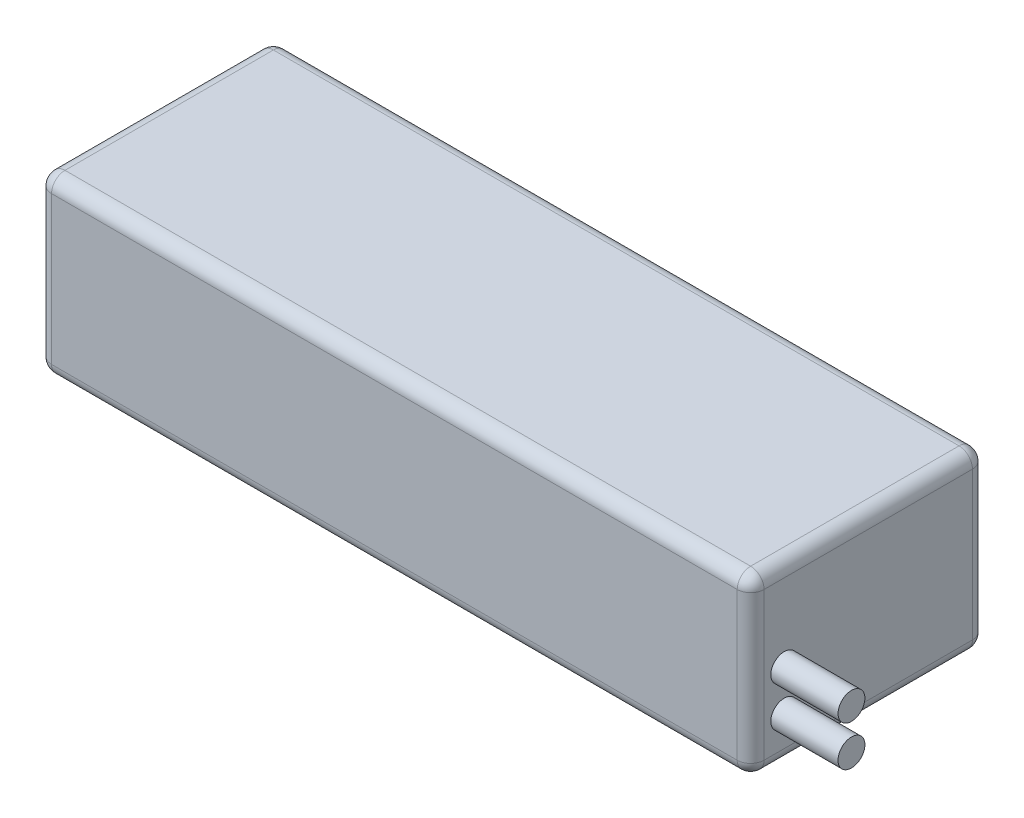
ISO-10303-21;
HEADER;
FILE_DESCRIPTION(('STEP AP214'),'2;1');
FILE_NAME('part.step','',(''),(''),'','','');
FILE_SCHEMA(('AUTOMOTIVE_DESIGN { 1 0 10303 214 1 1 1 1 }'));
ENDSEC;
DATA;
#1=APPLICATION_CONTEXT('core data for automotive mechanical design processes');
#2=APPLICATION_PROTOCOL_DEFINITION('international standard','automotive_design',2000,#1);
#3=PRODUCT_CONTEXT('',#1,'mechanical');
#4=PRODUCT('Part','Part','',(#3));
#5=PRODUCT_RELATED_PRODUCT_CATEGORY('part','',(#4));
#6=PRODUCT_DEFINITION_FORMATION('','',#4);
#7=PRODUCT_DEFINITION_CONTEXT('part definition',#1,'design');
#8=PRODUCT_DEFINITION('design','',#6,#7);
#9=PRODUCT_DEFINITION_SHAPE('','',#8);
#10=(LENGTH_UNIT() NAMED_UNIT(*) SI_UNIT(.MILLI.,.METRE.));
#11=(NAMED_UNIT(*) PLANE_ANGLE_UNIT() SI_UNIT($,.RADIAN.));
#12=(NAMED_UNIT(*) SI_UNIT($,.STERADIAN.) SOLID_ANGLE_UNIT());
#13=UNCERTAINTY_MEASURE_WITH_UNIT(LENGTH_MEASURE(1.E-05),#10,'distance_accuracy_value','');
#14=(GEOMETRIC_REPRESENTATION_CONTEXT(3) GLOBAL_UNCERTAINTY_ASSIGNED_CONTEXT((#13)) GLOBAL_UNIT_ASSIGNED_CONTEXT((#10,
#11,#12)) REPRESENTATION_CONTEXT('',''));
#15=CARTESIAN_POINT('',(0.,0.,0.));
#16=DIRECTION('',(0.,0.,1.));
#17=DIRECTION('',(1.,0.,0.));
#18=AXIS2_PLACEMENT_3D('',#15,#16,#17);
#19=CARTESIAN_POINT('',(53.,26.,-17.5));
#20=DIRECTION('',(-1.,0.,0.));
#21=DIRECTION('',(0.,0.,1.));
#22=AXIS2_PLACEMENT_3D('',#19,#20,#21);
#23=PLANE('',#22);
#24=CARTESIAN_POINT('',(53.,12.5,12.5));
#25=DIRECTION('',(-1.,0.,0.));
#26=DIRECTION('',(0.,0.,1.));
#27=AXIS2_PLACEMENT_3D('',#24,#25,#26);
#28=CIRCLE('',#27,2.);
#29=CARTESIAN_POINT('',(53.,12.5,14.5));
#30=VERTEX_POINT('',#29);
#31=EDGE_CURVE('E11',#30,#30,#28,.F.);
#32=ORIENTED_EDGE('',*,*,#31,.F.);
#33=EDGE_LOOP('',(#32));
#34=FACE_BOUND('',#33,.T.);
#35=CARTESIAN_POINT('',(53.,6.5,12.5));
#36=DIRECTION('',(-1.,0.,0.));
#37=DIRECTION('',(0.,0.,1.));
#38=AXIS2_PLACEMENT_3D('',#35,#36,#37);
#39=CIRCLE('',#38,2.);
#40=CARTESIAN_POINT('',(53.,6.5,14.5));
#41=VERTEX_POINT('',#40);
#42=EDGE_CURVE('E57',#41,#41,#39,.F.);
#43=ORIENTED_EDGE('',*,*,#42,.F.);
#44=EDGE_LOOP('',(#43));
#45=FACE_BOUND('',#44,.T.);
#46=DIRECTION('',(0.,-1.,0.));
#47=VECTOR('',#46,1.);
#48=CARTESIAN_POINT('',(53.,26.,15.5));
#49=LINE('',#48,#47);
#50=CARTESIAN_POINT('',(53.,24.,15.5));
#51=VERTEX_POINT('',#50);
#52=CARTESIAN_POINT('',(53.,2.,15.5));
#53=VERTEX_POINT('',#52);
#54=EDGE_CURVE('E214',#51,#53,#49,.T.);
#55=ORIENTED_EDGE('',*,*,#54,.T.);
#56=DIRECTION('',(0.,0.,-1.));
#57=VECTOR('',#56,1.);
#58=CARTESIAN_POINT('',(53.,2.,-17.5));
#59=LINE('',#58,#57);
#60=CARTESIAN_POINT('',(53.,2.,-15.5));
#61=VERTEX_POINT('',#60);
#62=EDGE_CURVE('E218',#53,#61,#59,.T.);
#63=ORIENTED_EDGE('',*,*,#62,.T.);
#64=DIRECTION('',(0.,-1.,0.));
#65=VECTOR('',#64,1.);
#66=CARTESIAN_POINT('',(53.,26.,-15.5));
#67=LINE('',#66,#65);
#68=CARTESIAN_POINT('',(53.,24.,-15.5));
#69=VERTEX_POINT('',#68);
#70=EDGE_CURVE('E211',#61,#69,#67,.F.);
#71=ORIENTED_EDGE('',*,*,#70,.T.);
#72=DIRECTION('',(0.,0.,-1.));
#73=VECTOR('',#72,1.);
#74=CARTESIAN_POINT('',(53.,24.,17.5));
#75=LINE('',#74,#73);
#76=EDGE_CURVE('E208',#69,#51,#75,.F.);
#77=ORIENTED_EDGE('',*,*,#76,.T.);
#78=EDGE_LOOP('',(#55,#63,#71,#77));
#79=FACE_BOUND('',#78,.T.);
#80=ADVANCED_FACE('F48',(#34,#45,#79),#23,.F.);
#81=CARTESIAN_POINT('',(-53.,26.,-17.5));
#82=DIRECTION('',(0.,0.,1.));
#83=DIRECTION('',(1.,0.,0.));
#84=AXIS2_PLACEMENT_3D('',#81,#82,#83);
#85=PLANE('',#84);
#86=DIRECTION('',(0.,-1.,0.));
#87=VECTOR('',#86,1.);
#88=CARTESIAN_POINT('',(51.,26.,-17.5));
#89=LINE('',#88,#87);
#90=CARTESIAN_POINT('',(51.,24.,-17.5));
#91=VERTEX_POINT('',#90);
#92=CARTESIAN_POINT('',(51.,2.,-17.5));
#93=VERTEX_POINT('',#92);
#94=EDGE_CURVE('E69',#91,#93,#89,.T.);
#95=ORIENTED_EDGE('',*,*,#94,.T.);
#96=DIRECTION('',(-1.,0.,0.));
#97=VECTOR('',#96,1.);
#98=CARTESIAN_POINT('',(-53.,2.,-17.5));
#99=LINE('',#98,#97);
#100=CARTESIAN_POINT('',(-51.,2.,-17.5));
#101=VERTEX_POINT('',#100);
#102=EDGE_CURVE('E64',#93,#101,#99,.T.);
#103=ORIENTED_EDGE('',*,*,#102,.T.);
#104=DIRECTION('',(0.,-1.,0.));
#105=VECTOR('',#104,1.);
#106=CARTESIAN_POINT('',(-51.,26.,-17.5));
#107=LINE('',#106,#105);
#108=CARTESIAN_POINT('',(-51.,24.,-17.5));
#109=VERTEX_POINT('',#108);
#110=EDGE_CURVE('E239',#101,#109,#107,.F.);
#111=ORIENTED_EDGE('',*,*,#110,.T.);
#112=DIRECTION('',(-1.,0.,0.));
#113=VECTOR('',#112,1.);
#114=CARTESIAN_POINT('',(53.,24.,-17.5));
#115=LINE('',#114,#113);
#116=EDGE_CURVE('E234',#109,#91,#115,.F.);
#117=ORIENTED_EDGE('',*,*,#116,.T.);
#118=EDGE_LOOP('',(#95,#103,#111,#117));
#119=FACE_BOUND('',#118,.T.);
#120=ADVANCED_FACE('F328',(#119),#85,.F.);
#121=CARTESIAN_POINT('',(-53.,26.,-17.5));
#122=DIRECTION('',(1.,0.,0.));
#123=DIRECTION('',(0.,0.,-1.));
#124=AXIS2_PLACEMENT_3D('',#121,#122,#123);
#125=PLANE('',#124);
#126=DIRECTION('',(0.,0.,1.));
#127=VECTOR('',#126,1.);
#128=CARTESIAN_POINT('',(-53.,2.,-17.5));
#129=LINE('',#128,#127);
#130=CARTESIAN_POINT('',(-53.,2.,-15.5));
#131=VERTEX_POINT('',#130);
#132=CARTESIAN_POINT('',(-53.,2.,15.5));
#133=VERTEX_POINT('',#132);
#134=EDGE_CURVE('E190',#131,#133,#129,.T.);
#135=ORIENTED_EDGE('',*,*,#134,.T.);
#136=DIRECTION('',(0.,-1.,0.));
#137=VECTOR('',#136,1.);
#138=CARTESIAN_POINT('',(-53.,26.,15.5));
#139=LINE('',#138,#137);
#140=CARTESIAN_POINT('',(-53.,24.,15.5));
#141=VERTEX_POINT('',#140);
#142=EDGE_CURVE('E145',#133,#141,#139,.F.);
#143=ORIENTED_EDGE('',*,*,#142,.T.);
#144=DIRECTION('',(0.,0.,1.));
#145=VECTOR('',#144,1.);
#146=CARTESIAN_POINT('',(-53.,24.,-17.5));
#147=LINE('',#146,#145);
#148=CARTESIAN_POINT('',(-53.,24.,-15.5));
#149=VERTEX_POINT('',#148);
#150=EDGE_CURVE('E183',#141,#149,#147,.F.);
#151=ORIENTED_EDGE('',*,*,#150,.T.);
#152=DIRECTION('',(0.,-1.,0.));
#153=VECTOR('',#152,1.);
#154=CARTESIAN_POINT('',(-53.,26.,-15.5));
#155=LINE('',#154,#153);
#156=EDGE_CURVE('E179',#149,#131,#155,.T.);
#157=ORIENTED_EDGE('',*,*,#156,.T.);
#158=EDGE_LOOP('',(#135,#143,#151,#157));
#159=FACE_BOUND('',#158,.T.);
#160=ADVANCED_FACE('F360',(#159),#125,.F.);
#161=CARTESIAN_POINT('',(-53.,26.,17.5));
#162=DIRECTION('',(0.,0.,-1.));
#163=DIRECTION('',(-1.,0.,0.));
#164=AXIS2_PLACEMENT_3D('',#161,#162,#163);
#165=PLANE('',#164);
#166=DIRECTION('',(1.,0.,0.));
#167=VECTOR('',#166,1.);
#168=CARTESIAN_POINT('',(-53.,24.,17.5));
#169=LINE('',#168,#167);
#170=CARTESIAN_POINT('',(51.,24.,17.5));
#171=VERTEX_POINT('',#170);
#172=CARTESIAN_POINT('',(-51.,24.,17.5));
#173=VERTEX_POINT('',#172);
#174=EDGE_CURVE('E176',#171,#173,#169,.F.);
#175=ORIENTED_EDGE('',*,*,#174,.T.);
#176=DIRECTION('',(0.,-1.,0.));
#177=VECTOR('',#176,1.);
#178=CARTESIAN_POINT('',(-51.,26.,17.5));
#179=LINE('',#178,#177);
#180=CARTESIAN_POINT('',(-51.,2.,17.5));
#181=VERTEX_POINT('',#180);
#182=EDGE_CURVE('E143',#173,#181,#179,.T.);
#183=ORIENTED_EDGE('',*,*,#182,.T.);
#184=DIRECTION('',(1.,0.,0.));
#185=VECTOR('',#184,1.);
#186=CARTESIAN_POINT('',(-53.,2.,17.5));
#187=LINE('',#186,#185);
#188=CARTESIAN_POINT('',(51.,2.,17.5));
#189=VERTEX_POINT('',#188);
#190=EDGE_CURVE('E164',#181,#189,#187,.T.);
#191=ORIENTED_EDGE('',*,*,#190,.T.);
#192=DIRECTION('',(0.,-1.,0.));
#193=VECTOR('',#192,1.);
#194=CARTESIAN_POINT('',(51.,26.,17.5));
#195=LINE('',#194,#193);
#196=EDGE_CURVE('E171',#189,#171,#195,.F.);
#197=ORIENTED_EDGE('',*,*,#196,.T.);
#198=EDGE_LOOP('',(#175,#183,#191,#197));
#199=FACE_BOUND('',#198,.T.);
#200=ADVANCED_FACE('F174',(#199),#165,.F.);
#201=CARTESIAN_POINT('',(0.,26.,0.));
#202=DIRECTION('',(0.,1.,0.));
#203=DIRECTION('',(0.,0.,1.));
#204=AXIS2_PLACEMENT_3D('',#201,#202,#203);
#205=PLANE('',#204);
#206=DIRECTION('',(0.,0.,1.));
#207=VECTOR('',#206,1.);
#208=CARTESIAN_POINT('',(-51.,26.,17.5));
#209=LINE('',#208,#207);
#210=CARTESIAN_POINT('',(-51.,26.,-15.5));
#211=VERTEX_POINT('',#210);
#212=CARTESIAN_POINT('',(-51.,26.,15.5));
#213=VERTEX_POINT('',#212);
#214=EDGE_CURVE('E201',#211,#213,#209,.T.);
#215=ORIENTED_EDGE('',*,*,#214,.T.);
#216=DIRECTION('',(1.,0.,0.));
#217=VECTOR('',#216,1.);
#218=CARTESIAN_POINT('',(53.,26.,15.5));
#219=LINE('',#218,#217);
#220=CARTESIAN_POINT('',(51.,26.,15.5));
#221=VERTEX_POINT('',#220);
#222=EDGE_CURVE('E204',#213,#221,#219,.T.);
#223=ORIENTED_EDGE('',*,*,#222,.T.);
#224=DIRECTION('',(0.,0.,-1.));
#225=VECTOR('',#224,1.);
#226=CARTESIAN_POINT('',(51.,26.,-17.5));
#227=LINE('',#226,#225);
#228=CARTESIAN_POINT('',(51.,26.,-15.5));
#229=VERTEX_POINT('',#228);
#230=EDGE_CURVE('E198',#221,#229,#227,.T.);
#231=ORIENTED_EDGE('',*,*,#230,.T.);
#232=DIRECTION('',(-1.,0.,0.));
#233=VECTOR('',#232,1.);
#234=CARTESIAN_POINT('',(-53.,26.,-15.5));
#235=LINE('',#234,#233);
#236=EDGE_CURVE('E195',#229,#211,#235,.T.);
#237=ORIENTED_EDGE('',*,*,#236,.T.);
#238=EDGE_LOOP('',(#215,#223,#231,#237));
#239=FACE_BOUND('',#238,.T.);
#240=ADVANCED_FACE('F426',(#239),#205,.T.);
#241=CARTESIAN_POINT('',(0.,0.,0.));
#242=DIRECTION('',(0.,1.,0.));
#243=DIRECTION('',(0.,0.,1.));
#244=AXIS2_PLACEMENT_3D('',#241,#242,#243);
#245=PLANE('',#244);
#246=DIRECTION('',(0.,0.,-1.));
#247=VECTOR('',#246,1.);
#248=CARTESIAN_POINT('',(51.,0.,0.));
#249=LINE('',#248,#247);
#250=CARTESIAN_POINT('',(51.,0.,-15.5));
#251=VERTEX_POINT('',#250);
#252=CARTESIAN_POINT('',(51.,0.,15.5));
#253=VERTEX_POINT('',#252);
#254=EDGE_CURVE('E224',#251,#253,#249,.F.);
#255=ORIENTED_EDGE('',*,*,#254,.T.);
#256=DIRECTION('',(1.,0.,0.));
#257=VECTOR('',#256,1.);
#258=CARTESIAN_POINT('',(0.,0.,15.5));
#259=LINE('',#258,#257);
#260=CARTESIAN_POINT('',(-51.,0.,15.5));
#261=VERTEX_POINT('',#260);
#262=EDGE_CURVE('E230',#253,#261,#259,.F.);
#263=ORIENTED_EDGE('',*,*,#262,.T.);
#264=DIRECTION('',(0.,0.,1.));
#265=VECTOR('',#264,1.);
#266=CARTESIAN_POINT('',(-51.,0.,0.));
#267=LINE('',#266,#265);
#268=CARTESIAN_POINT('',(-51.,0.,-15.5));
#269=VERTEX_POINT('',#268);
#270=EDGE_CURVE('E227',#261,#269,#267,.F.);
#271=ORIENTED_EDGE('',*,*,#270,.T.);
#272=DIRECTION('',(-1.,0.,0.));
#273=VECTOR('',#272,1.);
#274=CARTESIAN_POINT('',(0.,0.,-15.5));
#275=LINE('',#274,#273);
#276=EDGE_CURVE('E221',#269,#251,#275,.F.);
#277=ORIENTED_EDGE('',*,*,#276,.T.);
#278=EDGE_LOOP('',(#255,#263,#271,#277));
#279=FACE_BOUND('',#278,.T.);
#280=ADVANCED_FACE('F368',(#279),#245,.F.);
#281=CARTESIAN_POINT('',(51.,26.,-15.5));
#282=DIRECTION('',(0.,-1.,0.));
#283=DIRECTION('',(0.,0.,-1.));
#284=AXIS2_PLACEMENT_3D('',#281,#282,#283);
#285=CYLINDRICAL_SURFACE('',#284,2.);
#286=CARTESIAN_POINT('',(51.,24.,-15.5));
#287=DIRECTION('',(0.,1.,0.));
#288=DIRECTION('',(0.,0.,1.));
#289=AXIS2_PLACEMENT_3D('',#286,#287,#288);
#290=CIRCLE('',#289,2.);
#291=EDGE_CURVE('E172',#69,#91,#290,.T.);
#292=ORIENTED_EDGE('',*,*,#291,.F.);
#293=ORIENTED_EDGE('',*,*,#70,.F.);
#294=CARTESIAN_POINT('',(51.,2.,-15.5));
#295=DIRECTION('',(0.,-1.,0.));
#296=DIRECTION('',(0.,0.,-1.));
#297=AXIS2_PLACEMENT_3D('',#294,#295,#296);
#298=CIRCLE('',#297,2.);
#299=EDGE_CURVE('E314',#93,#61,#298,.T.);
#300=ORIENTED_EDGE('',*,*,#299,.F.);
#301=ORIENTED_EDGE('',*,*,#94,.F.);
#302=EDGE_LOOP('',(#292,#293,#300,#301));
#303=FACE_BOUND('',#302,.T.);
#304=ADVANCED_FACE('F50',(#303),#285,.T.);
#305=CARTESIAN_POINT('',(51.,24.,-15.5));
#306=DIRECTION('',(0.,0.,-1.));
#307=DIRECTION('',(-1.,0.,0.));
#308=AXIS2_PLACEMENT_3D('',#305,#306,#307);
#309=SPHERICAL_SURFACE('',#308,2.);
#310=CARTESIAN_POINT('',(51.,24.,-15.5));
#311=DIRECTION('',(0.,0.,-1.));
#312=DIRECTION('',(-1.,0.,0.));
#313=AXIS2_PLACEMENT_3D('',#310,#311,#312);
#314=CIRCLE('',#313,2.);
#315=EDGE_CURVE('E306',#69,#229,#314,.F.);
#316=ORIENTED_EDGE('',*,*,#315,.F.);
#317=ORIENTED_EDGE('',*,*,#291,.T.);
#318=CARTESIAN_POINT('',(51.,24.,-15.5));
#319=DIRECTION('',(1.,0.,0.));
#320=DIRECTION('',(0.,0.,-1.));
#321=AXIS2_PLACEMENT_3D('',#318,#319,#320);
#322=CIRCLE('',#321,2.);
#323=EDGE_CURVE('E310',#229,#91,#322,.F.);
#324=ORIENTED_EDGE('',*,*,#323,.F.);
#325=EDGE_LOOP('',(#316,#317,#324));
#326=FACE_BOUND('',#325,.T.);
#327=ADVANCED_FACE('F411',(#326),#309,.T.);
#328=CARTESIAN_POINT('',(51.,2.,-15.5));
#329=DIRECTION('',(1.,0.,0.));
#330=DIRECTION('',(0.,1.,0.));
#331=AXIS2_PLACEMENT_3D('',#328,#329,#330);
#332=SPHERICAL_SURFACE('',#331,2.);
#333=CARTESIAN_POINT('',(51.,2.,-15.5));
#334=DIRECTION('',(1.,0.,0.));
#335=DIRECTION('',(0.,0.,-1.));
#336=AXIS2_PLACEMENT_3D('',#333,#334,#335);
#337=CIRCLE('',#336,2.);
#338=EDGE_CURVE('E298',#93,#251,#337,.F.);
#339=ORIENTED_EDGE('',*,*,#338,.F.);
#340=ORIENTED_EDGE('',*,*,#299,.T.);
#341=CARTESIAN_POINT('',(51.,2.,-15.5));
#342=DIRECTION('',(0.,0.,-1.));
#343=DIRECTION('',(-1.,0.,0.));
#344=AXIS2_PLACEMENT_3D('',#341,#342,#343);
#345=CIRCLE('',#344,2.);
#346=EDGE_CURVE('E302',#251,#61,#345,.F.);
#347=ORIENTED_EDGE('',*,*,#346,.F.);
#348=EDGE_LOOP('',(#339,#340,#347));
#349=FACE_BOUND('',#348,.T.);
#350=ADVANCED_FACE('F408',(#349),#332,.T.);
#351=CARTESIAN_POINT('',(0.,24.,-15.5));
#352=DIRECTION('',(1.,0.,0.));
#353=DIRECTION('',(0.,0.,-1.));
#354=AXIS2_PLACEMENT_3D('',#351,#352,#353);
#355=CYLINDRICAL_SURFACE('',#354,2.);
#356=ORIENTED_EDGE('',*,*,#323,.T.);
#357=ORIENTED_EDGE('',*,*,#116,.F.);
#358=CARTESIAN_POINT('',(-51.,24.,-15.5));
#359=DIRECTION('',(-1.,0.,0.));
#360=DIRECTION('',(0.,0.,1.));
#361=AXIS2_PLACEMENT_3D('',#358,#359,#360);
#362=CIRCLE('',#361,2.);
#363=EDGE_CURVE('E291',#211,#109,#362,.T.);
#364=ORIENTED_EDGE('',*,*,#363,.F.);
#365=ORIENTED_EDGE('',*,*,#236,.F.);
#366=EDGE_LOOP('',(#356,#357,#364,#365));
#367=FACE_BOUND('',#366,.T.);
#368=ADVANCED_FACE('F405',(#367),#355,.T.);
#369=CARTESIAN_POINT('',(51.,24.,0.));
#370=DIRECTION('',(0.,0.,1.));
#371=DIRECTION('',(1.,0.,0.));
#372=AXIS2_PLACEMENT_3D('',#369,#370,#371);
#373=CYLINDRICAL_SURFACE('',#372,2.);
#374=ORIENTED_EDGE('',*,*,#315,.T.);
#375=ORIENTED_EDGE('',*,*,#230,.F.);
#376=CARTESIAN_POINT('',(51.,24.,15.5));
#377=DIRECTION('',(0.,0.,1.));
#378=DIRECTION('',(0.,-1.,0.));
#379=AXIS2_PLACEMENT_3D('',#376,#377,#378);
#380=CIRCLE('',#379,2.);
#381=EDGE_CURVE('E287',#51,#221,#380,.T.);
#382=ORIENTED_EDGE('',*,*,#381,.F.);
#383=ORIENTED_EDGE('',*,*,#76,.F.);
#384=EDGE_LOOP('',(#374,#375,#382,#383));
#385=FACE_BOUND('',#384,.T.);
#386=ADVANCED_FACE('F343',(#385),#373,.T.);
#387=CARTESIAN_POINT('',(51.,26.,15.5));
#388=DIRECTION('',(0.,-1.,0.));
#389=DIRECTION('',(0.,0.,-1.));
#390=AXIS2_PLACEMENT_3D('',#387,#388,#389);
#391=CYLINDRICAL_SURFACE('',#390,2.);
#392=CARTESIAN_POINT('',(51.,2.,15.5));
#393=DIRECTION('',(0.,-1.,0.));
#394=DIRECTION('',(0.,0.,-1.));
#395=AXIS2_PLACEMENT_3D('',#392,#393,#394);
#396=CIRCLE('',#395,2.);
#397=EDGE_CURVE('E279',#53,#189,#396,.T.);
#398=ORIENTED_EDGE('',*,*,#397,.F.);
#399=ORIENTED_EDGE('',*,*,#54,.F.);
#400=CARTESIAN_POINT('',(51.,24.,15.5));
#401=DIRECTION('',(0.,1.,0.));
#402=DIRECTION('',(0.,0.,1.));
#403=AXIS2_PLACEMENT_3D('',#400,#401,#402);
#404=CIRCLE('',#403,2.);
#405=EDGE_CURVE('E283',#171,#51,#404,.T.);
#406=ORIENTED_EDGE('',*,*,#405,.F.);
#407=ORIENTED_EDGE('',*,*,#196,.F.);
#408=EDGE_LOOP('',(#398,#399,#406,#407));
#409=FACE_BOUND('',#408,.T.);
#410=ADVANCED_FACE('F339',(#409),#391,.T.);
#411=CARTESIAN_POINT('',(51.,2.,-17.5));
#412=DIRECTION('',(0.,0.,-1.));
#413=DIRECTION('',(-1.,0.,0.));
#414=AXIS2_PLACEMENT_3D('',#411,#412,#413);
#415=CYLINDRICAL_SURFACE('',#414,2.);
#416=ORIENTED_EDGE('',*,*,#346,.T.);
#417=ORIENTED_EDGE('',*,*,#62,.F.);
#418=CARTESIAN_POINT('',(51.,2.,15.5));
#419=DIRECTION('',(0.,0.,1.));
#420=DIRECTION('',(1.,0.,0.));
#421=AXIS2_PLACEMENT_3D('',#418,#419,#420);
#422=CIRCLE('',#421,2.);
#423=EDGE_CURVE('E276',#253,#53,#422,.T.);
#424=ORIENTED_EDGE('',*,*,#423,.F.);
#425=ORIENTED_EDGE('',*,*,#254,.F.);
#426=EDGE_LOOP('',(#416,#417,#424,#425));
#427=FACE_BOUND('',#426,.T.);
#428=ADVANCED_FACE('F372',(#427),#415,.T.);
#429=CARTESIAN_POINT('',(-53.,2.,-15.5));
#430=DIRECTION('',(-1.,0.,0.));
#431=DIRECTION('',(0.,0.,1.));
#432=AXIS2_PLACEMENT_3D('',#429,#430,#431);
#433=CYLINDRICAL_SURFACE('',#432,2.);
#434=ORIENTED_EDGE('',*,*,#338,.T.);
#435=ORIENTED_EDGE('',*,*,#276,.F.);
#436=CARTESIAN_POINT('',(-51.,2.,-15.5));
#437=DIRECTION('',(-1.,0.,0.));
#438=DIRECTION('',(0.,0.,1.));
#439=AXIS2_PLACEMENT_3D('',#436,#437,#438);
#440=CIRCLE('',#439,2.);
#441=EDGE_CURVE('E272',#101,#269,#440,.T.);
#442=ORIENTED_EDGE('',*,*,#441,.F.);
#443=ORIENTED_EDGE('',*,*,#102,.F.);
#444=EDGE_LOOP('',(#434,#435,#442,#443));
#445=FACE_BOUND('',#444,.T.);
#446=ADVANCED_FACE('F394',(#445),#433,.T.);
#447=CARTESIAN_POINT('',(-51.,26.,-15.5));
#448=DIRECTION('',(0.,-1.,0.));
#449=DIRECTION('',(0.,0.,-1.));
#450=AXIS2_PLACEMENT_3D('',#447,#448,#449);
#451=CYLINDRICAL_SURFACE('',#450,2.);
#452=CARTESIAN_POINT('',(-51.,24.,-15.5));
#453=DIRECTION('',(0.,1.,0.));
#454=DIRECTION('',(0.,0.,1.));
#455=AXIS2_PLACEMENT_3D('',#452,#453,#454);
#456=CIRCLE('',#455,2.);
#457=EDGE_CURVE('E294',#109,#149,#456,.T.);
#458=ORIENTED_EDGE('',*,*,#457,.F.);
#459=ORIENTED_EDGE('',*,*,#110,.F.);
#460=CARTESIAN_POINT('',(-51.,2.,-15.5));
#461=DIRECTION('',(0.,-1.,0.));
#462=DIRECTION('',(0.,0.,-1.));
#463=AXIS2_PLACEMENT_3D('',#460,#461,#462);
#464=CIRCLE('',#463,2.);
#465=EDGE_CURVE('E268',#131,#101,#464,.T.);
#466=ORIENTED_EDGE('',*,*,#465,.F.);
#467=ORIENTED_EDGE('',*,*,#156,.F.);
#468=EDGE_LOOP('',(#458,#459,#466,#467));
#469=FACE_BOUND('',#468,.T.);
#470=ADVANCED_FACE('F390',(#469),#451,.T.);
#471=CARTESIAN_POINT('',(-51.,24.,-15.5));
#472=DIRECTION('',(0.,0.,-1.));
#473=DIRECTION('',(-1.,0.,0.));
#474=AXIS2_PLACEMENT_3D('',#471,#472,#473);
#475=SPHERICAL_SURFACE('',#474,2.);
#476=ORIENTED_EDGE('',*,*,#363,.T.);
#477=ORIENTED_EDGE('',*,*,#457,.T.);
#478=CARTESIAN_POINT('',(-51.,24.,-15.5));
#479=DIRECTION('',(0.,0.,-1.));
#480=DIRECTION('',(-1.,0.,0.));
#481=AXIS2_PLACEMENT_3D('',#478,#479,#480);
#482=CIRCLE('',#481,2.);
#483=EDGE_CURVE('E264',#211,#149,#482,.F.);
#484=ORIENTED_EDGE('',*,*,#483,.F.);
#485=EDGE_LOOP('',(#476,#477,#484));
#486=FACE_BOUND('',#485,.T.);
#487=ADVANCED_FACE('F384',(#486),#475,.T.);
#488=CARTESIAN_POINT('',(51.,24.,15.5));
#489=DIRECTION('',(1.,0.,0.));
#490=DIRECTION('',(0.,0.,-1.));
#491=AXIS2_PLACEMENT_3D('',#488,#489,#490);
#492=SPHERICAL_SURFACE('',#491,2.);
#493=ORIENTED_EDGE('',*,*,#405,.T.);
#494=ORIENTED_EDGE('',*,*,#381,.T.);
#495=CARTESIAN_POINT('',(51.,24.,15.5));
#496=DIRECTION('',(1.,0.,0.));
#497=DIRECTION('',(0.,0.,-1.));
#498=AXIS2_PLACEMENT_3D('',#495,#496,#497);
#499=CIRCLE('',#498,2.);
#500=EDGE_CURVE('E261',#171,#221,#499,.F.);
#501=ORIENTED_EDGE('',*,*,#500,.F.);
#502=EDGE_LOOP('',(#493,#494,#501));
#503=FACE_BOUND('',#502,.T.);
#504=ADVANCED_FACE('F345',(#503),#492,.T.);
#505=CARTESIAN_POINT('',(51.,2.,15.5));
#506=DIRECTION('',(1.,0.,0.));
#507=DIRECTION('',(0.,0.,-1.));
#508=AXIS2_PLACEMENT_3D('',#505,#506,#507);
#509=SPHERICAL_SURFACE('',#508,2.);
#510=ORIENTED_EDGE('',*,*,#423,.T.);
#511=ORIENTED_EDGE('',*,*,#397,.T.);
#512=CARTESIAN_POINT('',(51.,2.,15.5));
#513=DIRECTION('',(1.,0.,0.));
#514=DIRECTION('',(0.,0.,-1.));
#515=AXIS2_PLACEMENT_3D('',#512,#513,#514);
#516=CIRCLE('',#515,2.);
#517=EDGE_CURVE('E167',#253,#189,#516,.F.);
#518=ORIENTED_EDGE('',*,*,#517,.F.);
#519=EDGE_LOOP('',(#510,#511,#518));
#520=FACE_BOUND('',#519,.T.);
#521=ADVANCED_FACE('F374',(#520),#509,.T.);
#522=CARTESIAN_POINT('',(-51.,2.,-15.5));
#523=DIRECTION('',(0.,0.,-1.));
#524=DIRECTION('',(0.,1.,0.));
#525=AXIS2_PLACEMENT_3D('',#522,#523,#524);
#526=SPHERICAL_SURFACE('',#525,2.);
#527=ORIENTED_EDGE('',*,*,#465,.T.);
#528=ORIENTED_EDGE('',*,*,#441,.T.);
#529=CARTESIAN_POINT('',(-51.,2.,-15.5));
#530=DIRECTION('',(0.,0.,-1.));
#531=DIRECTION('',(-1.,0.,0.));
#532=AXIS2_PLACEMENT_3D('',#529,#530,#531);
#533=CIRCLE('',#532,2.);
#534=EDGE_CURVE('E255',#131,#269,#533,.F.);
#535=ORIENTED_EDGE('',*,*,#534,.F.);
#536=EDGE_LOOP('',(#527,#528,#535));
#537=FACE_BOUND('',#536,.T.);
#538=ADVANCED_FACE('F376',(#537),#526,.T.);
#539=CARTESIAN_POINT('',(-51.,24.,0.));
#540=DIRECTION('',(0.,0.,-1.));
#541=DIRECTION('',(-1.,0.,0.));
#542=AXIS2_PLACEMENT_3D('',#539,#540,#541);
#543=CYLINDRICAL_SURFACE('',#542,2.);
#544=ORIENTED_EDGE('',*,*,#483,.T.);
#545=ORIENTED_EDGE('',*,*,#150,.F.);
#546=CARTESIAN_POINT('',(-51.,24.,15.5));
#547=DIRECTION('',(0.,0.,1.));
#548=DIRECTION('',(1.,0.,0.));
#549=AXIS2_PLACEMENT_3D('',#546,#547,#548);
#550=CIRCLE('',#549,2.);
#551=EDGE_CURVE('E251',#213,#141,#550,.T.);
#552=ORIENTED_EDGE('',*,*,#551,.F.);
#553=ORIENTED_EDGE('',*,*,#214,.F.);
#554=EDGE_LOOP('',(#544,#545,#552,#553));
#555=FACE_BOUND('',#554,.T.);
#556=ADVANCED_FACE('F356',(#555),#543,.T.);
#557=CARTESIAN_POINT('',(0.,24.,15.5));
#558=DIRECTION('',(-1.,0.,0.));
#559=DIRECTION('',(0.,0.,1.));
#560=AXIS2_PLACEMENT_3D('',#557,#558,#559);
#561=CYLINDRICAL_SURFACE('',#560,2.);
#562=ORIENTED_EDGE('',*,*,#500,.T.);
#563=ORIENTED_EDGE('',*,*,#222,.F.);
#564=CARTESIAN_POINT('',(-51.,24.,15.5));
#565=DIRECTION('',(-1.,0.,0.));
#566=DIRECTION('',(0.,0.,1.));
#567=AXIS2_PLACEMENT_3D('',#564,#565,#566);
#568=CIRCLE('',#567,2.);
#569=EDGE_CURVE('E161',#173,#213,#568,.T.);
#570=ORIENTED_EDGE('',*,*,#569,.F.);
#571=ORIENTED_EDGE('',*,*,#174,.F.);
#572=EDGE_LOOP('',(#562,#563,#570,#571));
#573=FACE_BOUND('',#572,.T.);
#574=ADVANCED_FACE('F348',(#573),#561,.T.);
#575=CARTESIAN_POINT('',(-53.,2.,15.5));
#576=DIRECTION('',(1.,0.,0.));
#577=DIRECTION('',(0.,0.,-1.));
#578=AXIS2_PLACEMENT_3D('',#575,#576,#577);
#579=CYLINDRICAL_SURFACE('',#578,2.);
#580=ORIENTED_EDGE('',*,*,#517,.T.);
#581=ORIENTED_EDGE('',*,*,#190,.F.);
#582=CARTESIAN_POINT('',(-51.,2.,15.5));
#583=DIRECTION('',(-1.,0.,0.));
#584=DIRECTION('',(0.,0.,1.));
#585=AXIS2_PLACEMENT_3D('',#582,#583,#584);
#586=CIRCLE('',#585,2.);
#587=EDGE_CURVE('E152',#261,#181,#586,.T.);
#588=ORIENTED_EDGE('',*,*,#587,.F.);
#589=ORIENTED_EDGE('',*,*,#262,.F.);
#590=EDGE_LOOP('',(#580,#581,#588,#589));
#591=FACE_BOUND('',#590,.T.);
#592=ADVANCED_FACE('F165',(#591),#579,.T.);
#593=CARTESIAN_POINT('',(-51.,2.,-17.5));
#594=DIRECTION('',(0.,0.,1.));
#595=DIRECTION('',(1.,0.,0.));
#596=AXIS2_PLACEMENT_3D('',#593,#594,#595);
#597=CYLINDRICAL_SURFACE('',#596,2.);
#598=ORIENTED_EDGE('',*,*,#534,.T.);
#599=ORIENTED_EDGE('',*,*,#270,.F.);
#600=CARTESIAN_POINT('',(-51.,2.,15.5));
#601=DIRECTION('',(0.,0.,1.));
#602=DIRECTION('',(1.,0.,0.));
#603=AXIS2_PLACEMENT_3D('',#600,#601,#602);
#604=CIRCLE('',#603,2.);
#605=EDGE_CURVE('E156',#133,#261,#604,.T.);
#606=ORIENTED_EDGE('',*,*,#605,.F.);
#607=ORIENTED_EDGE('',*,*,#134,.F.);
#608=EDGE_LOOP('',(#598,#599,#606,#607));
#609=FACE_BOUND('',#608,.T.);
#610=ADVANCED_FACE('F364',(#609),#597,.T.);
#611=CARTESIAN_POINT('',(-51.,24.,15.5));
#612=DIRECTION('',(0.,1.,0.));
#613=DIRECTION('',(0.,0.,1.));
#614=AXIS2_PLACEMENT_3D('',#611,#612,#613);
#615=SPHERICAL_SURFACE('',#614,2.);
#616=ORIENTED_EDGE('',*,*,#569,.T.);
#617=ORIENTED_EDGE('',*,*,#551,.T.);
#618=CARTESIAN_POINT('',(-51.,24.,15.5));
#619=DIRECTION('',(0.,1.,0.));
#620=DIRECTION('',(0.,0.,1.));
#621=AXIS2_PLACEMENT_3D('',#618,#619,#620);
#622=CIRCLE('',#621,2.);
#623=EDGE_CURVE('E148',#173,#141,#622,.F.);
#624=ORIENTED_EDGE('',*,*,#623,.F.);
#625=EDGE_LOOP('',(#616,#617,#624));
#626=FACE_BOUND('',#625,.T.);
#627=ADVANCED_FACE('F352',(#626),#615,.T.);
#628=CARTESIAN_POINT('',(-51.,2.,15.5));
#629=DIRECTION('',(0.,-1.,0.));
#630=DIRECTION('',(0.,0.,-1.));
#631=AXIS2_PLACEMENT_3D('',#628,#629,#630);
#632=SPHERICAL_SURFACE('',#631,2.);
#633=ORIENTED_EDGE('',*,*,#605,.T.);
#634=ORIENTED_EDGE('',*,*,#587,.T.);
#635=CARTESIAN_POINT('',(-51.,2.,15.5));
#636=DIRECTION('',(0.,-1.,0.));
#637=DIRECTION('',(0.,0.,-1.));
#638=AXIS2_PLACEMENT_3D('',#635,#636,#637);
#639=CIRCLE('',#638,2.);
#640=EDGE_CURVE('E139',#133,#181,#639,.F.);
#641=ORIENTED_EDGE('',*,*,#640,.F.);
#642=EDGE_LOOP('',(#633,#634,#641));
#643=FACE_BOUND('',#642,.T.);
#644=ADVANCED_FACE('F154',(#643),#632,.T.);
#645=CARTESIAN_POINT('',(-51.,26.,15.5));
#646=DIRECTION('',(0.,-1.,0.));
#647=DIRECTION('',(0.,0.,-1.));
#648=AXIS2_PLACEMENT_3D('',#645,#646,#647);
#649=CYLINDRICAL_SURFACE('',#648,2.);
#650=ORIENTED_EDGE('',*,*,#623,.T.);
#651=ORIENTED_EDGE('',*,*,#142,.F.);
#652=ORIENTED_EDGE('',*,*,#640,.T.);
#653=ORIENTED_EDGE('',*,*,#182,.F.);
#654=EDGE_LOOP('',(#650,#651,#652,#653));
#655=FACE_BOUND('',#654,.T.);
#656=ADVANCED_FACE('F141',(#655),#649,.T.);
#657=CARTESIAN_POINT('',(63.,6.5,12.5));
#658=DIRECTION('',(-1.,0.,0.));
#659=DIRECTION('',(0.,0.,1.));
#660=AXIS2_PLACEMENT_3D('',#657,#658,#659);
#661=CYLINDRICAL_SURFACE('',#660,2.);
#662=CARTESIAN_POINT('',(63.,6.5,12.5));
#663=DIRECTION('',(1.,0.,0.));
#664=DIRECTION('',(0.,0.,-1.));
#665=AXIS2_PLACEMENT_3D('',#662,#663,#664);
#666=CIRCLE('',#665,2.);
#667=CARTESIAN_POINT('',(63.,6.5,10.5));
#668=VERTEX_POINT('',#667);
#669=EDGE_CURVE('E149',#668,#668,#666,.T.);
#670=ORIENTED_EDGE('',*,*,#669,.F.);
#671=EDGE_LOOP('',(#670));
#672=FACE_BOUND('',#671,.T.);
#673=ORIENTED_EDGE('',*,*,#42,.T.);
#674=EDGE_LOOP('',(#673));
#675=FACE_BOUND('',#674,.T.);
#676=ADVANCED_FACE('F324',(#672,#675),#661,.T.);
#677=CARTESIAN_POINT('',(63.,6.5,12.5));
#678=DIRECTION('',(1.,0.,0.));
#679=DIRECTION('',(0.,0.,-1.));
#680=AXIS2_PLACEMENT_3D('',#677,#678,#679);
#681=PLANE('',#680);
#682=ORIENTED_EDGE('',*,*,#669,.T.);
#683=EDGE_LOOP('',(#682));
#684=FACE_BOUND('',#683,.T.);
#685=ADVANCED_FACE('F488',(#684),#681,.T.);
#686=CARTESIAN_POINT('',(63.,12.5,12.5));
#687=DIRECTION('',(-1.,0.,0.));
#688=DIRECTION('',(0.,0.,1.));
#689=AXIS2_PLACEMENT_3D('',#686,#687,#688);
#690=CYLINDRICAL_SURFACE('',#689,2.);
#691=CARTESIAN_POINT('',(63.,12.5,12.5));
#692=DIRECTION('',(1.,0.,0.));
#693=DIRECTION('',(0.,0.,-1.));
#694=AXIS2_PLACEMENT_3D('',#691,#692,#693);
#695=CIRCLE('',#694,2.);
#696=CARTESIAN_POINT('',(63.,12.5,10.5));
#697=VERTEX_POINT('',#696);
#698=EDGE_CURVE('E823',#697,#697,#695,.T.);
#699=ORIENTED_EDGE('',*,*,#698,.F.);
#700=EDGE_LOOP('',(#699));
#701=FACE_BOUND('',#700,.T.);
#702=ORIENTED_EDGE('',*,*,#31,.T.);
#703=EDGE_LOOP('',(#702));
#704=FACE_BOUND('',#703,.T.);
#705=ADVANCED_FACE('F495',(#701,#704),#690,.T.);
#706=CARTESIAN_POINT('',(63.,12.5,12.5));
#707=DIRECTION('',(1.,0.,0.));
#708=DIRECTION('',(0.,0.,-1.));
#709=AXIS2_PLACEMENT_3D('',#706,#707,#708);
#710=PLANE('',#709);
#711=ORIENTED_EDGE('',*,*,#698,.T.);
#712=EDGE_LOOP('',(#711));
#713=FACE_BOUND('',#712,.T.);
#714=ADVANCED_FACE('F502',(#713),#710,.T.);
#715=CLOSED_SHELL('',(#80,#120,#160,#200,#240,#280,#304,#327,#350,#368,#386,#410,#428,#446,#470,
#487,#504,#521,#538,#556,#574,#592,#610,#627,#644,#656,#676,#685,#705,#714));
#716=MANIFOLD_SOLID_BREP('B2',#715);
#717=ADVANCED_BREP_SHAPE_REPRESENTATION('',(#18,#716),#14);
#718=SHAPE_DEFINITION_REPRESENTATION(#9,#717);
ENDSEC;
END-ISO-10303-21;
